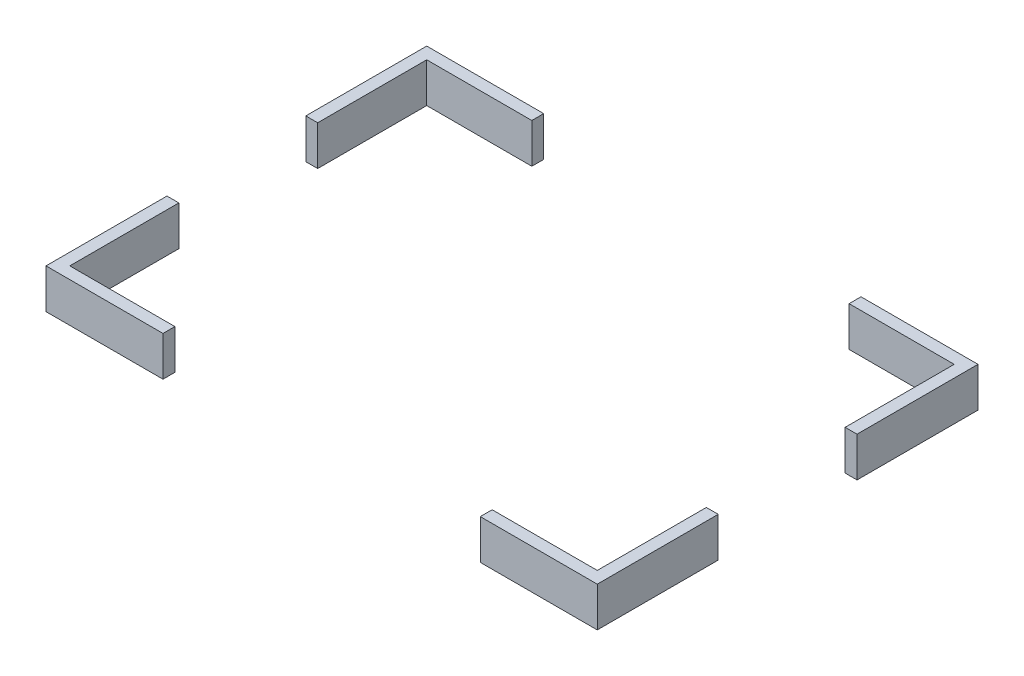
ISO-10303-21;
HEADER;
FILE_DESCRIPTION(('STEP AP214'),'2;1');
FILE_NAME('part.step','',(''),(''),'','','');
FILE_SCHEMA(('AUTOMOTIVE_DESIGN { 1 0 10303 214 1 1 1 1 }'));
ENDSEC;
DATA;
#1=APPLICATION_CONTEXT('core data for automotive mechanical design processes');
#2=APPLICATION_PROTOCOL_DEFINITION('international standard','automotive_design',2000,#1);
#3=PRODUCT_CONTEXT('',#1,'mechanical');
#4=PRODUCT('Part','Part','',(#3));
#5=PRODUCT_RELATED_PRODUCT_CATEGORY('part','',(#4));
#6=PRODUCT_DEFINITION_FORMATION('','',#4);
#7=PRODUCT_DEFINITION_CONTEXT('part definition',#1,'design');
#8=PRODUCT_DEFINITION('design','',#6,#7);
#9=PRODUCT_DEFINITION_SHAPE('','',#8);
#10=(LENGTH_UNIT() NAMED_UNIT(*) SI_UNIT(.MILLI.,.METRE.));
#11=(NAMED_UNIT(*) PLANE_ANGLE_UNIT() SI_UNIT($,.RADIAN.));
#12=(NAMED_UNIT(*) SI_UNIT($,.STERADIAN.) SOLID_ANGLE_UNIT());
#13=UNCERTAINTY_MEASURE_WITH_UNIT(LENGTH_MEASURE(1.E-05),#10,'distance_accuracy_value','');
#14=(GEOMETRIC_REPRESENTATION_CONTEXT(3) GLOBAL_UNCERTAINTY_ASSIGNED_CONTEXT((#13)) GLOBAL_UNIT_ASSIGNED_CONTEXT((#10,
#11,#12)) REPRESENTATION_CONTEXT('',''));
#15=CARTESIAN_POINT('',(0.,0.,0.));
#16=DIRECTION('',(0.,0.,1.));
#17=DIRECTION('',(1.,0.,0.));
#18=AXIS2_PLACEMENT_3D('',#15,#16,#17);
#19=CARTESIAN_POINT('',(-69.5,10.,-48.));
#20=DIRECTION('',(0.,0.,1.));
#21=DIRECTION('',(1.,0.,0.));
#22=AXIS2_PLACEMENT_3D('',#19,#20,#21);
#23=PLANE('',#22);
#24=DIRECTION('',(-1.,0.,0.));
#25=VECTOR('',#24,1.);
#26=CARTESIAN_POINT('',(-69.5,10.,-48.));
#27=LINE('',#26,#25);
#28=CARTESIAN_POINT('',(-40.,10.,-48.));
#29=VERTEX_POINT('',#28);
#30=CARTESIAN_POINT('',(-69.5,10.,-48.));
#31=VERTEX_POINT('',#30);
#32=EDGE_CURVE('E136',#29,#31,#27,.T.);
#33=ORIENTED_EDGE('',*,*,#32,.F.);
#34=DIRECTION('',(0.,-1.,0.));
#35=VECTOR('',#34,1.);
#36=CARTESIAN_POINT('',(-40.,10.,-48.));
#37=LINE('',#36,#35);
#38=CARTESIAN_POINT('',(-40.,0.,-48.));
#39=VERTEX_POINT('',#38);
#40=EDGE_CURVE('E68',#29,#39,#37,.T.);
#41=ORIENTED_EDGE('',*,*,#40,.T.);
#42=DIRECTION('',(-1.,0.,0.));
#43=VECTOR('',#42,1.);
#44=CARTESIAN_POINT('',(-69.5,0.,-48.));
#45=LINE('',#44,#43);
#46=CARTESIAN_POINT('',(-69.5,0.,-48.));
#47=VERTEX_POINT('',#46);
#48=EDGE_CURVE('E117',#39,#47,#45,.T.);
#49=ORIENTED_EDGE('',*,*,#48,.T.);
#50=DIRECTION('',(0.,-1.,0.));
#51=VECTOR('',#50,1.);
#52=CARTESIAN_POINT('',(-69.5,10.,-48.));
#53=LINE('',#52,#51);
#54=EDGE_CURVE('E130',#31,#47,#53,.T.);
#55=ORIENTED_EDGE('',*,*,#54,.F.);
#56=EDGE_LOOP('',(#33,#41,#49,#55));
#57=FACE_BOUND('',#56,.T.);
#58=ADVANCED_FACE('F50',(#57),#23,.F.);
#59=CARTESIAN_POINT('',(-66.5,10.,-45.));
#60=DIRECTION('',(0.,0.,1.));
#61=DIRECTION('',(1.,0.,0.));
#62=AXIS2_PLACEMENT_3D('',#59,#60,#61);
#63=PLANE('',#62);
#64=DIRECTION('',(0.,-1.,0.));
#65=VECTOR('',#64,1.);
#66=CARTESIAN_POINT('',(-40.,10.,-45.));
#67=LINE('',#66,#65);
#68=CARTESIAN_POINT('',(-40.,10.,-45.));
#69=VERTEX_POINT('',#68);
#70=CARTESIAN_POINT('',(-40.,0.,-45.));
#71=VERTEX_POINT('',#70);
#72=EDGE_CURVE('E12',#69,#71,#67,.T.);
#73=ORIENTED_EDGE('',*,*,#72,.F.);
#74=DIRECTION('',(-1.,0.,0.));
#75=VECTOR('',#74,1.);
#76=CARTESIAN_POINT('',(-66.5,10.,-45.));
#77=LINE('',#76,#75);
#78=CARTESIAN_POINT('',(-66.5,10.,-45.));
#79=VERTEX_POINT('',#78);
#80=EDGE_CURVE('E108',#69,#79,#77,.T.);
#81=ORIENTED_EDGE('',*,*,#80,.T.);
#82=DIRECTION('',(0.,-1.,0.));
#83=VECTOR('',#82,1.);
#84=CARTESIAN_POINT('',(-66.5,10.,-45.));
#85=LINE('',#84,#83);
#86=CARTESIAN_POINT('',(-66.5,0.,-45.));
#87=VERTEX_POINT('',#86);
#88=EDGE_CURVE('E116',#79,#87,#85,.T.);
#89=ORIENTED_EDGE('',*,*,#88,.T.);
#90=DIRECTION('',(-1.,0.,0.));
#91=VECTOR('',#90,1.);
#92=CARTESIAN_POINT('',(-66.5,0.,-45.));
#93=LINE('',#92,#91);
#94=EDGE_CURVE('E110',#71,#87,#93,.T.);
#95=ORIENTED_EDGE('',*,*,#94,.F.);
#96=EDGE_LOOP('',(#73,#81,#89,#95));
#97=FACE_BOUND('',#96,.T.);
#98=ADVANCED_FACE('F106',(#97),#63,.T.);
#99=CARTESIAN_POINT('',(0.,0.,0.));
#100=DIRECTION('',(0.,1.,0.));
#101=DIRECTION('',(0.,0.,1.));
#102=AXIS2_PLACEMENT_3D('',#99,#100,#101);
#103=PLANE('',#102);
#104=ORIENTED_EDGE('',*,*,#48,.F.);
#105=DIRECTION('',(0.,0.,1.));
#106=VECTOR('',#105,1.);
#107=CARTESIAN_POINT('',(-40.,0.,0.));
#108=LINE('',#107,#106);
#109=EDGE_CURVE('E119',#39,#71,#108,.T.);
#110=ORIENTED_EDGE('',*,*,#109,.T.);
#111=ORIENTED_EDGE('',*,*,#94,.T.);
#112=DIRECTION('',(0.,0.,1.));
#113=VECTOR('',#112,1.);
#114=CARTESIAN_POINT('',(-66.5,0.,-45.));
#115=LINE('',#114,#113);
#116=CARTESIAN_POINT('',(-66.5,0.,-17.5));
#117=VERTEX_POINT('',#116);
#118=EDGE_CURVE('E124',#87,#117,#115,.T.);
#119=ORIENTED_EDGE('',*,*,#118,.T.);
#120=DIRECTION('',(-1.,0.,0.));
#121=VECTOR('',#120,1.);
#122=CARTESIAN_POINT('',(0.,0.,-17.5));
#123=LINE('',#122,#121);
#124=CARTESIAN_POINT('',(-69.5,0.,-17.5));
#125=VERTEX_POINT('',#124);
#126=EDGE_CURVE('E53',#117,#125,#123,.T.);
#127=ORIENTED_EDGE('',*,*,#126,.T.);
#128=DIRECTION('',(0.,0.,1.));
#129=VECTOR('',#128,1.);
#130=CARTESIAN_POINT('',(-69.5,0.,-48.));
#131=LINE('',#130,#129);
#132=EDGE_CURVE('E140',#47,#125,#131,.T.);
#133=ORIENTED_EDGE('',*,*,#132,.F.);
#134=EDGE_LOOP('',(#104,#110,#111,#119,#127,#133));
#135=FACE_BOUND('',#134,.T.);
#136=ADVANCED_FACE('F172',(#135),#103,.F.);
#137=CARTESIAN_POINT('',(0.,10.,0.));
#138=DIRECTION('',(0.,1.,0.));
#139=DIRECTION('',(0.,0.,1.));
#140=AXIS2_PLACEMENT_3D('',#137,#138,#139);
#141=PLANE('',#140);
#142=DIRECTION('',(0.,0.,1.));
#143=VECTOR('',#142,1.);
#144=CARTESIAN_POINT('',(-40.,10.,0.));
#145=LINE('',#144,#143);
#146=EDGE_CURVE('E59',#29,#69,#145,.T.);
#147=ORIENTED_EDGE('',*,*,#146,.F.);
#148=ORIENTED_EDGE('',*,*,#32,.T.);
#149=DIRECTION('',(0.,0.,1.));
#150=VECTOR('',#149,1.);
#151=CARTESIAN_POINT('',(-69.5,10.,-48.));
#152=LINE('',#151,#150);
#153=CARTESIAN_POINT('',(-69.5,10.,-17.5));
#154=VERTEX_POINT('',#153);
#155=EDGE_CURVE('E137',#31,#154,#152,.T.);
#156=ORIENTED_EDGE('',*,*,#155,.T.);
#157=DIRECTION('',(-1.,0.,0.));
#158=VECTOR('',#157,1.);
#159=CARTESIAN_POINT('',(0.,10.,-17.5));
#160=LINE('',#159,#158);
#161=CARTESIAN_POINT('',(-66.5,10.,-17.5));
#162=VERTEX_POINT('',#161);
#163=EDGE_CURVE('E102',#162,#154,#160,.T.);
#164=ORIENTED_EDGE('',*,*,#163,.F.);
#165=DIRECTION('',(0.,0.,1.));
#166=VECTOR('',#165,1.);
#167=CARTESIAN_POINT('',(-66.5,10.,-45.));
#168=LINE('',#167,#166);
#169=EDGE_CURVE('E115',#79,#162,#168,.T.);
#170=ORIENTED_EDGE('',*,*,#169,.F.);
#171=ORIENTED_EDGE('',*,*,#80,.F.);
#172=EDGE_LOOP('',(#147,#148,#156,#164,#170,#171));
#173=FACE_BOUND('',#172,.T.);
#174=ADVANCED_FACE('F112',(#173),#141,.T.);
#175=CARTESIAN_POINT('',(-69.5,10.,-48.));
#176=DIRECTION('',(1.,0.,0.));
#177=DIRECTION('',(0.,0.,-1.));
#178=AXIS2_PLACEMENT_3D('',#175,#176,#177);
#179=PLANE('',#178);
#180=ORIENTED_EDGE('',*,*,#132,.T.);
#181=DIRECTION('',(0.,1.,0.));
#182=VECTOR('',#181,1.);
#183=CARTESIAN_POINT('',(-69.5,9.99999999999999,-17.5));
#184=LINE('',#183,#182);
#185=EDGE_CURVE('E134',#125,#154,#184,.T.);
#186=ORIENTED_EDGE('',*,*,#185,.T.);
#187=ORIENTED_EDGE('',*,*,#155,.F.);
#188=ORIENTED_EDGE('',*,*,#54,.T.);
#189=EDGE_LOOP('',(#180,#186,#187,#188));
#190=FACE_BOUND('',#189,.T.);
#191=ADVANCED_FACE('F154',(#190),#179,.F.);
#192=CARTESIAN_POINT('',(-66.5,10.,-45.));
#193=DIRECTION('',(1.,0.,0.));
#194=DIRECTION('',(0.,0.,-1.));
#195=AXIS2_PLACEMENT_3D('',#192,#193,#194);
#196=PLANE('',#195);
#197=DIRECTION('',(0.,1.,0.));
#198=VECTOR('',#197,1.);
#199=CARTESIAN_POINT('',(-66.5,9.99999999999999,-17.5));
#200=LINE('',#199,#198);
#201=EDGE_CURVE('E125',#117,#162,#200,.T.);
#202=ORIENTED_EDGE('',*,*,#201,.F.);
#203=ORIENTED_EDGE('',*,*,#118,.F.);
#204=ORIENTED_EDGE('',*,*,#88,.F.);
#205=ORIENTED_EDGE('',*,*,#169,.T.);
#206=EDGE_LOOP('',(#202,#203,#204,#205));
#207=FACE_BOUND('',#206,.T.);
#208=ADVANCED_FACE('F156',(#207),#196,.T.);
#209=CARTESIAN_POINT('',(-530.5,15.,-17.5));
#210=DIRECTION('',(0.,0.,-1.));
#211=DIRECTION('',(0.,1.,0.));
#212=AXIS2_PLACEMENT_3D('',#209,#210,#211);
#213=PLANE('',#212);
#214=ORIENTED_EDGE('',*,*,#126,.F.);
#215=ORIENTED_EDGE('',*,*,#201,.T.);
#216=ORIENTED_EDGE('',*,*,#163,.T.);
#217=ORIENTED_EDGE('',*,*,#185,.F.);
#218=EDGE_LOOP('',(#214,#215,#216,#217));
#219=FACE_BOUND('',#218,.T.);
#220=ADVANCED_FACE('F158',(#219),#213,.F.);
#221=CARTESIAN_POINT('',(-40.,-40.,-58.8496360731405));
#222=DIRECTION('',(-1.,0.,0.));
#223=DIRECTION('',(0.,0.,1.));
#224=AXIS2_PLACEMENT_3D('',#221,#222,#223);
#225=PLANE('',#224);
#226=ORIENTED_EDGE('',*,*,#146,.T.);
#227=ORIENTED_EDGE('',*,*,#72,.T.);
#228=ORIENTED_EDGE('',*,*,#109,.F.);
#229=ORIENTED_EDGE('',*,*,#40,.F.);
#230=EDGE_LOOP('',(#226,#227,#228,#229));
#231=FACE_BOUND('',#230,.T.);
#232=ADVANCED_FACE('F98',(#231),#225,.F.);
#233=CLOSED_SHELL('',(#58,#98,#136,#174,#191,#208,#220,#232));
#234=MANIFOLD_SOLID_BREP('B2',#233);
#235=CARTESIAN_POINT('',(0.,10.,0.));
#236=DIRECTION('',(0.,1.,0.));
#237=DIRECTION('',(0.,0.,1.));
#238=AXIS2_PLACEMENT_3D('',#235,#236,#237);
#239=PLANE('',#238);
#240=DIRECTION('',(0.,0.,1.));
#241=VECTOR('',#240,1.);
#242=CARTESIAN_POINT('',(-40.,10.,-58.8496360731405));
#243=LINE('',#242,#241);
#244=CARTESIAN_POINT('',(-40.,10.,45.));
#245=VERTEX_POINT('',#244);
#246=CARTESIAN_POINT('',(-40.,10.,48.));
#247=VERTEX_POINT('',#246);
#248=EDGE_CURVE('E48',#245,#247,#243,.T.);
#249=ORIENTED_EDGE('',*,*,#248,.F.);
#250=DIRECTION('',(1.,0.,0.));
#251=VECTOR('',#250,1.);
#252=CARTESIAN_POINT('',(-66.5,10.,45.));
#253=LINE('',#252,#251);
#254=CARTESIAN_POINT('',(-66.5,10.,45.));
#255=VERTEX_POINT('',#254);
#256=EDGE_CURVE('E296',#255,#245,#253,.T.);
#257=ORIENTED_EDGE('',*,*,#256,.F.);
#258=DIRECTION('',(0.,0.,1.));
#259=VECTOR('',#258,1.);
#260=CARTESIAN_POINT('',(-66.5,10.,-45.));
#261=LINE('',#260,#259);
#262=CARTESIAN_POINT('',(-66.5,10.,17.5));
#263=VERTEX_POINT('',#262);
#264=EDGE_CURVE('E330',#263,#255,#261,.T.);
#265=ORIENTED_EDGE('',*,*,#264,.F.);
#266=DIRECTION('',(1.,0.,0.));
#267=VECTOR('',#266,1.);
#268=CARTESIAN_POINT('',(0.,10.,17.5));
#269=LINE('',#268,#267);
#270=CARTESIAN_POINT('',(-69.5,10.,17.5));
#271=VERTEX_POINT('',#270);
#272=EDGE_CURVE('E312',#271,#263,#269,.T.);
#273=ORIENTED_EDGE('',*,*,#272,.F.);
#274=DIRECTION('',(0.,0.,1.));
#275=VECTOR('',#274,1.);
#276=CARTESIAN_POINT('',(-69.5,10.,-48.));
#277=LINE('',#276,#275);
#278=CARTESIAN_POINT('',(-69.5,10.,48.));
#279=VERTEX_POINT('',#278);
#280=EDGE_CURVE('E322',#271,#279,#277,.T.);
#281=ORIENTED_EDGE('',*,*,#280,.T.);
#282=DIRECTION('',(1.,0.,0.));
#283=VECTOR('',#282,1.);
#284=CARTESIAN_POINT('',(-69.5,10.,48.));
#285=LINE('',#284,#283);
#286=EDGE_CURVE('E239',#279,#247,#285,.T.);
#287=ORIENTED_EDGE('',*,*,#286,.T.);
#288=EDGE_LOOP('',(#249,#257,#265,#273,#281,#287));
#289=FACE_BOUND('',#288,.T.);
#290=ADVANCED_FACE('F236',(#289),#239,.T.);
#291=CARTESIAN_POINT('',(0.,0.,0.));
#292=DIRECTION('',(0.,1.,0.));
#293=DIRECTION('',(0.,0.,1.));
#294=AXIS2_PLACEMENT_3D('',#291,#292,#293);
#295=PLANE('',#294);
#296=DIRECTION('',(1.,0.,0.));
#297=VECTOR('',#296,1.);
#298=CARTESIAN_POINT('',(-66.5,0.,45.));
#299=LINE('',#298,#297);
#300=CARTESIAN_POINT('',(-66.5,0.,45.));
#301=VERTEX_POINT('',#300);
#302=CARTESIAN_POINT('',(-40.,0.,45.));
#303=VERTEX_POINT('',#302);
#304=EDGE_CURVE('E319',#301,#303,#299,.T.);
#305=ORIENTED_EDGE('',*,*,#304,.T.);
#306=DIRECTION('',(0.,0.,1.));
#307=VECTOR('',#306,1.);
#308=CARTESIAN_POINT('',(-40.,0.,0.));
#309=LINE('',#308,#307);
#310=CARTESIAN_POINT('',(-40.,0.,48.));
#311=VERTEX_POINT('',#310);
#312=EDGE_CURVE('E282',#303,#311,#309,.T.);
#313=ORIENTED_EDGE('',*,*,#312,.T.);
#314=DIRECTION('',(1.,0.,0.));
#315=VECTOR('',#314,1.);
#316=CARTESIAN_POINT('',(-69.5,0.,48.));
#317=LINE('',#316,#315);
#318=CARTESIAN_POINT('',(-69.5,0.,48.));
#319=VERTEX_POINT('',#318);
#320=EDGE_CURVE('E313',#319,#311,#317,.T.);
#321=ORIENTED_EDGE('',*,*,#320,.F.);
#322=DIRECTION('',(0.,0.,1.));
#323=VECTOR('',#322,1.);
#324=CARTESIAN_POINT('',(-69.5,0.,-48.));
#325=LINE('',#324,#323);
#326=CARTESIAN_POINT('',(-69.5,0.,17.5));
#327=VERTEX_POINT('',#326);
#328=EDGE_CURVE('E306',#327,#319,#325,.T.);
#329=ORIENTED_EDGE('',*,*,#328,.F.);
#330=DIRECTION('',(1.,0.,0.));
#331=VECTOR('',#330,1.);
#332=CARTESIAN_POINT('',(0.,0.,17.5));
#333=LINE('',#332,#331);
#334=CARTESIAN_POINT('',(-66.5,0.,17.5));
#335=VERTEX_POINT('',#334);
#336=EDGE_CURVE('E317',#327,#335,#333,.T.);
#337=ORIENTED_EDGE('',*,*,#336,.T.);
#338=DIRECTION('',(0.,0.,1.));
#339=VECTOR('',#338,1.);
#340=CARTESIAN_POINT('',(-66.5,0.,-45.));
#341=LINE('',#340,#339);
#342=EDGE_CURVE('E316',#335,#301,#341,.T.);
#343=ORIENTED_EDGE('',*,*,#342,.T.);
#344=EDGE_LOOP('',(#305,#313,#321,#329,#337,#343));
#345=FACE_BOUND('',#344,.T.);
#346=ADVANCED_FACE('F337',(#345),#295,.F.);
#347=CARTESIAN_POINT('',(-69.5,10.,48.));
#348=DIRECTION('',(0.,0.,-1.));
#349=DIRECTION('',(-1.,0.,0.));
#350=AXIS2_PLACEMENT_3D('',#347,#348,#349);
#351=PLANE('',#350);
#352=ORIENTED_EDGE('',*,*,#320,.T.);
#353=DIRECTION('',(0.,1.,0.));
#354=VECTOR('',#353,1.);
#355=CARTESIAN_POINT('',(-40.,10.,48.));
#356=LINE('',#355,#354);
#357=EDGE_CURVE('E253',#311,#247,#356,.T.);
#358=ORIENTED_EDGE('',*,*,#357,.T.);
#359=ORIENTED_EDGE('',*,*,#286,.F.);
#360=DIRECTION('',(0.,-1.,0.));
#361=VECTOR('',#360,1.);
#362=CARTESIAN_POINT('',(-69.5,10.,48.));
#363=LINE('',#362,#361);
#364=EDGE_CURVE('E303',#279,#319,#363,.T.);
#365=ORIENTED_EDGE('',*,*,#364,.T.);
#366=EDGE_LOOP('',(#352,#358,#359,#365));
#367=FACE_BOUND('',#366,.T.);
#368=ADVANCED_FACE('F333',(#367),#351,.F.);
#369=CARTESIAN_POINT('',(-66.5,10.,45.));
#370=DIRECTION('',(0.,0.,-1.));
#371=DIRECTION('',(-1.,0.,0.));
#372=AXIS2_PLACEMENT_3D('',#369,#370,#371);
#373=PLANE('',#372);
#374=DIRECTION('',(0.,1.,0.));
#375=VECTOR('',#374,1.);
#376=CARTESIAN_POINT('',(-40.,10.,45.));
#377=LINE('',#376,#375);
#378=EDGE_CURVE('E245',#303,#245,#377,.T.);
#379=ORIENTED_EDGE('',*,*,#378,.F.);
#380=ORIENTED_EDGE('',*,*,#304,.F.);
#381=DIRECTION('',(0.,-1.,0.));
#382=VECTOR('',#381,1.);
#383=CARTESIAN_POINT('',(-66.5,10.,45.));
#384=LINE('',#383,#382);
#385=EDGE_CURVE('E301',#255,#301,#384,.T.);
#386=ORIENTED_EDGE('',*,*,#385,.F.);
#387=ORIENTED_EDGE('',*,*,#256,.T.);
#388=EDGE_LOOP('',(#379,#380,#386,#387));
#389=FACE_BOUND('',#388,.T.);
#390=ADVANCED_FACE('F299',(#389),#373,.T.);
#391=CARTESIAN_POINT('',(-69.5,10.,-48.));
#392=DIRECTION('',(1.,0.,0.));
#393=DIRECTION('',(0.,0.,-1.));
#394=AXIS2_PLACEMENT_3D('',#391,#392,#393);
#395=PLANE('',#394);
#396=ORIENTED_EDGE('',*,*,#280,.F.);
#397=DIRECTION('',(0.,-1.,0.));
#398=VECTOR('',#397,1.);
#399=CARTESIAN_POINT('',(-69.5,9.99999999999998,17.5));
#400=LINE('',#399,#398);
#401=EDGE_CURVE('E302',#271,#327,#400,.T.);
#402=ORIENTED_EDGE('',*,*,#401,.T.);
#403=ORIENTED_EDGE('',*,*,#328,.T.);
#404=ORIENTED_EDGE('',*,*,#364,.F.);
#405=EDGE_LOOP('',(#396,#402,#403,#404));
#406=FACE_BOUND('',#405,.T.);
#407=ADVANCED_FACE('F346',(#406),#395,.F.);
#408=CARTESIAN_POINT('',(-66.5,10.,-45.));
#409=DIRECTION('',(1.,0.,0.));
#410=DIRECTION('',(0.,0.,-1.));
#411=AXIS2_PLACEMENT_3D('',#408,#409,#410);
#412=PLANE('',#411);
#413=DIRECTION('',(0.,-1.,0.));
#414=VECTOR('',#413,1.);
#415=CARTESIAN_POINT('',(-66.5,9.99999999999999,17.5));
#416=LINE('',#415,#414);
#417=EDGE_CURVE('E290',#263,#335,#416,.T.);
#418=ORIENTED_EDGE('',*,*,#417,.F.);
#419=ORIENTED_EDGE('',*,*,#264,.T.);
#420=ORIENTED_EDGE('',*,*,#385,.T.);
#421=ORIENTED_EDGE('',*,*,#342,.F.);
#422=EDGE_LOOP('',(#418,#419,#420,#421));
#423=FACE_BOUND('',#422,.T.);
#424=ADVANCED_FACE('F343',(#423),#412,.T.);
#425=CARTESIAN_POINT('',(-530.5,15.,17.5));
#426=DIRECTION('',(0.,0.,1.));
#427=DIRECTION('',(0.,-1.,0.));
#428=AXIS2_PLACEMENT_3D('',#425,#426,#427);
#429=PLANE('',#428);
#430=ORIENTED_EDGE('',*,*,#272,.T.);
#431=ORIENTED_EDGE('',*,*,#417,.T.);
#432=ORIENTED_EDGE('',*,*,#336,.F.);
#433=ORIENTED_EDGE('',*,*,#401,.F.);
#434=EDGE_LOOP('',(#430,#431,#432,#433));
#435=FACE_BOUND('',#434,.T.);
#436=ADVANCED_FACE('F345',(#435),#429,.F.);
#437=CARTESIAN_POINT('',(-40.,-40.,-58.8496360731405));
#438=DIRECTION('',(-1.,0.,0.));
#439=DIRECTION('',(0.,0.,1.));
#440=AXIS2_PLACEMENT_3D('',#437,#438,#439);
#441=PLANE('',#440);
#442=ORIENTED_EDGE('',*,*,#312,.F.);
#443=ORIENTED_EDGE('',*,*,#378,.T.);
#444=ORIENTED_EDGE('',*,*,#248,.T.);
#445=ORIENTED_EDGE('',*,*,#357,.F.);
#446=EDGE_LOOP('',(#442,#443,#444,#445));
#447=FACE_BOUND('',#446,.T.);
#448=ADVANCED_FACE('F285',(#447),#441,.F.);
#449=CLOSED_SHELL('',(#290,#346,#368,#390,#407,#424,#436,#448));
#450=MANIFOLD_SOLID_BREP('B6',#449);
#451=CARTESIAN_POINT('',(-530.5,15.,17.5));
#452=DIRECTION('',(0.,0.,1.));
#453=DIRECTION('',(0.,-1.,0.));
#454=AXIS2_PLACEMENT_3D('',#451,#452,#453);
#455=PLANE('',#454);
#456=DIRECTION('',(1.,0.,0.));
#457=VECTOR('',#456,1.);
#458=CARTESIAN_POINT('',(0.,10.,17.5));
#459=LINE('',#458,#457);
#460=CARTESIAN_POINT('',(66.5,10.,17.5));
#461=VERTEX_POINT('',#460);
#462=CARTESIAN_POINT('',(69.5,10.,17.5));
#463=VERTEX_POINT('',#462);
#464=EDGE_CURVE('E454',#461,#463,#459,.T.);
#465=ORIENTED_EDGE('',*,*,#464,.T.);
#466=DIRECTION('',(0.,-1.,0.));
#467=VECTOR('',#466,1.);
#468=CARTESIAN_POINT('',(69.5,15.,17.5));
#469=LINE('',#468,#467);
#470=CARTESIAN_POINT('',(69.5,0.,17.5));
#471=VERTEX_POINT('',#470);
#472=EDGE_CURVE('E510',#463,#471,#469,.T.);
#473=ORIENTED_EDGE('',*,*,#472,.T.);
#474=DIRECTION('',(1.,0.,0.));
#475=VECTOR('',#474,1.);
#476=CARTESIAN_POINT('',(0.,0.,17.5));
#477=LINE('',#476,#475);
#478=CARTESIAN_POINT('',(66.5,0.,17.5));
#479=VERTEX_POINT('',#478);
#480=EDGE_CURVE('E511',#479,#471,#477,.T.);
#481=ORIENTED_EDGE('',*,*,#480,.F.);
#482=DIRECTION('',(0.,1.,0.));
#483=VECTOR('',#482,1.);
#484=CARTESIAN_POINT('',(66.5,9.99999999999999,17.5));
#485=LINE('',#484,#483);
#486=EDGE_CURVE('E429',#479,#461,#485,.T.);
#487=ORIENTED_EDGE('',*,*,#486,.T.);
#488=EDGE_LOOP('',(#465,#473,#481,#487));
#489=FACE_BOUND('',#488,.T.);
#490=ADVANCED_FACE('F421',(#489),#455,.F.);
#491=CARTESIAN_POINT('',(69.5,10.,-48.));
#492=DIRECTION('',(-1.,0.,0.));
#493=DIRECTION('',(0.,0.,1.));
#494=AXIS2_PLACEMENT_3D('',#491,#492,#493);
#495=PLANE('',#494);
#496=DIRECTION('',(0.,0.,-1.));
#497=VECTOR('',#496,1.);
#498=CARTESIAN_POINT('',(69.5,0.,-48.));
#499=LINE('',#498,#497);
#500=CARTESIAN_POINT('',(69.5,0.,48.));
#501=VERTEX_POINT('',#500);
#502=EDGE_CURVE('E514',#501,#471,#499,.T.);
#503=ORIENTED_EDGE('',*,*,#502,.T.);
#504=ORIENTED_EDGE('',*,*,#472,.F.);
#505=DIRECTION('',(0.,0.,-1.));
#506=VECTOR('',#505,1.);
#507=CARTESIAN_POINT('',(69.5,10.,-48.));
#508=LINE('',#507,#506);
#509=CARTESIAN_POINT('',(69.5,10.,48.));
#510=VERTEX_POINT('',#509);
#511=EDGE_CURVE('E497',#510,#463,#508,.T.);
#512=ORIENTED_EDGE('',*,*,#511,.F.);
#513=DIRECTION('',(0.,-1.,0.));
#514=VECTOR('',#513,1.);
#515=CARTESIAN_POINT('',(69.5,10.,48.));
#516=LINE('',#515,#514);
#517=EDGE_CURVE('E495',#510,#501,#516,.T.);
#518=ORIENTED_EDGE('',*,*,#517,.T.);
#519=EDGE_LOOP('',(#503,#504,#512,#518));
#520=FACE_BOUND('',#519,.T.);
#521=ADVANCED_FACE('F529',(#520),#495,.F.);
#522=CARTESIAN_POINT('',(66.5,10.,-45.));
#523=DIRECTION('',(-1.,0.,0.));
#524=DIRECTION('',(0.,0.,1.));
#525=AXIS2_PLACEMENT_3D('',#522,#523,#524);
#526=PLANE('',#525);
#527=ORIENTED_EDGE('',*,*,#486,.F.);
#528=DIRECTION('',(0.,0.,-1.));
#529=VECTOR('',#528,1.);
#530=CARTESIAN_POINT('',(66.5,0.,-45.));
#531=LINE('',#530,#529);
#532=CARTESIAN_POINT('',(66.5,0.,45.));
#533=VERTEX_POINT('',#532);
#534=EDGE_CURVE('E507',#533,#479,#531,.T.);
#535=ORIENTED_EDGE('',*,*,#534,.F.);
#536=DIRECTION('',(0.,-1.,0.));
#537=VECTOR('',#536,1.);
#538=CARTESIAN_POINT('',(66.5,10.,45.));
#539=LINE('',#538,#537);
#540=CARTESIAN_POINT('',(66.5,10.,45.));
#541=VERTEX_POINT('',#540);
#542=EDGE_CURVE('E504',#541,#533,#539,.T.);
#543=ORIENTED_EDGE('',*,*,#542,.F.);
#544=DIRECTION('',(0.,0.,-1.));
#545=VECTOR('',#544,1.);
#546=CARTESIAN_POINT('',(66.5,10.,-45.));
#547=LINE('',#546,#545);
#548=EDGE_CURVE('E518',#541,#461,#547,.T.);
#549=ORIENTED_EDGE('',*,*,#548,.T.);
#550=EDGE_LOOP('',(#527,#535,#543,#549));
#551=FACE_BOUND('',#550,.T.);
#552=ADVANCED_FACE('F525',(#551),#526,.T.);
#553=CARTESIAN_POINT('',(-66.5,10.,45.));
#554=DIRECTION('',(0.,0.,-1.));
#555=DIRECTION('',(-1.,0.,0.));
#556=AXIS2_PLACEMENT_3D('',#553,#554,#555);
#557=PLANE('',#556);
#558=DIRECTION('',(0.,-1.,0.));
#559=VECTOR('',#558,1.);
#560=CARTESIAN_POINT('',(40.,10.,45.));
#561=LINE('',#560,#559);
#562=CARTESIAN_POINT('',(40.,10.,45.));
#563=VERTEX_POINT('',#562);
#564=CARTESIAN_POINT('',(40.,0.,45.));
#565=VERTEX_POINT('',#564);
#566=EDGE_CURVE('E234',#563,#565,#561,.T.);
#567=ORIENTED_EDGE('',*,*,#566,.F.);
#568=DIRECTION('',(1.,0.,0.));
#569=VECTOR('',#568,1.);
#570=CARTESIAN_POINT('',(-66.5,10.,45.));
#571=LINE('',#570,#569);
#572=EDGE_CURVE('E491',#563,#541,#571,.T.);
#573=ORIENTED_EDGE('',*,*,#572,.T.);
#574=ORIENTED_EDGE('',*,*,#542,.T.);
#575=DIRECTION('',(1.,0.,0.));
#576=VECTOR('',#575,1.);
#577=CARTESIAN_POINT('',(-66.5,0.,45.));
#578=LINE('',#577,#576);
#579=EDGE_CURVE('E461',#565,#533,#578,.T.);
#580=ORIENTED_EDGE('',*,*,#579,.F.);
#581=EDGE_LOOP('',(#567,#573,#574,#580));
#582=FACE_BOUND('',#581,.T.);
#583=ADVANCED_FACE('F531',(#582),#557,.T.);
#584=CARTESIAN_POINT('',(-69.5,10.,48.));
#585=DIRECTION('',(0.,0.,-1.));
#586=DIRECTION('',(-1.,0.,0.));
#587=AXIS2_PLACEMENT_3D('',#584,#585,#586);
#588=PLANE('',#587);
#589=DIRECTION('',(1.,0.,0.));
#590=VECTOR('',#589,1.);
#591=CARTESIAN_POINT('',(-69.5,10.,48.));
#592=LINE('',#591,#590);
#593=CARTESIAN_POINT('',(40.,10.,48.));
#594=VERTEX_POINT('',#593);
#595=EDGE_CURVE('E484',#594,#510,#592,.T.);
#596=ORIENTED_EDGE('',*,*,#595,.F.);
#597=DIRECTION('',(0.,-1.,0.));
#598=VECTOR('',#597,1.);
#599=CARTESIAN_POINT('',(40.,10.,48.));
#600=LINE('',#599,#598);
#601=CARTESIAN_POINT('',(40.,0.,48.));
#602=VERTEX_POINT('',#601);
#603=EDGE_CURVE('E478',#594,#602,#600,.T.);
#604=ORIENTED_EDGE('',*,*,#603,.T.);
#605=DIRECTION('',(1.,0.,0.));
#606=VECTOR('',#605,1.);
#607=CARTESIAN_POINT('',(-69.5,0.,48.));
#608=LINE('',#607,#606);
#609=EDGE_CURVE('E502',#602,#501,#608,.T.);
#610=ORIENTED_EDGE('',*,*,#609,.T.);
#611=ORIENTED_EDGE('',*,*,#517,.F.);
#612=EDGE_LOOP('',(#596,#604,#610,#611));
#613=FACE_BOUND('',#612,.T.);
#614=ADVANCED_FACE('F493',(#613),#588,.F.);
#615=CARTESIAN_POINT('',(0.,0.,0.));
#616=DIRECTION('',(0.,1.,0.));
#617=DIRECTION('',(0.,0.,1.));
#618=AXIS2_PLACEMENT_3D('',#615,#616,#617);
#619=PLANE('',#618);
#620=ORIENTED_EDGE('',*,*,#609,.F.);
#621=DIRECTION('',(0.,0.,-1.));
#622=VECTOR('',#621,1.);
#623=CARTESIAN_POINT('',(40.,0.,0.));
#624=LINE('',#623,#622);
#625=EDGE_CURVE('E480',#602,#565,#624,.T.);
#626=ORIENTED_EDGE('',*,*,#625,.T.);
#627=ORIENTED_EDGE('',*,*,#579,.T.);
#628=ORIENTED_EDGE('',*,*,#534,.T.);
#629=ORIENTED_EDGE('',*,*,#480,.T.);
#630=ORIENTED_EDGE('',*,*,#502,.F.);
#631=EDGE_LOOP('',(#620,#626,#627,#628,#629,#630));
#632=FACE_BOUND('',#631,.T.);
#633=ADVANCED_FACE('F521',(#632),#619,.F.);
#634=CARTESIAN_POINT('',(0.,10.,0.));
#635=DIRECTION('',(0.,1.,0.));
#636=DIRECTION('',(0.,0.,1.));
#637=AXIS2_PLACEMENT_3D('',#634,#635,#636);
#638=PLANE('',#637);
#639=DIRECTION('',(0.,0.,-1.));
#640=VECTOR('',#639,1.);
#641=CARTESIAN_POINT('',(40.,10.,-58.8496360731405));
#642=LINE('',#641,#640);
#643=EDGE_CURVE('E435',#594,#563,#642,.T.);
#644=ORIENTED_EDGE('',*,*,#643,.F.);
#645=ORIENTED_EDGE('',*,*,#595,.T.);
#646=ORIENTED_EDGE('',*,*,#511,.T.);
#647=ORIENTED_EDGE('',*,*,#464,.F.);
#648=ORIENTED_EDGE('',*,*,#548,.F.);
#649=ORIENTED_EDGE('',*,*,#572,.F.);
#650=EDGE_LOOP('',(#644,#645,#646,#647,#648,#649));
#651=FACE_BOUND('',#650,.T.);
#652=ADVANCED_FACE('F423',(#651),#638,.T.);
#653=CARTESIAN_POINT('',(40.,-40.,-58.8496360731405));
#654=DIRECTION('',(1.,0.,0.));
#655=DIRECTION('',(0.,0.,-1.));
#656=AXIS2_PLACEMENT_3D('',#653,#654,#655);
#657=PLANE('',#656);
#658=ORIENTED_EDGE('',*,*,#643,.T.);
#659=ORIENTED_EDGE('',*,*,#566,.T.);
#660=ORIENTED_EDGE('',*,*,#625,.F.);
#661=ORIENTED_EDGE('',*,*,#603,.F.);
#662=EDGE_LOOP('',(#658,#659,#660,#661));
#663=FACE_BOUND('',#662,.T.);
#664=ADVANCED_FACE('F479',(#663),#657,.F.);
#665=CLOSED_SHELL('',(#490,#521,#552,#583,#614,#633,#652,#664));
#666=MANIFOLD_SOLID_BREP('B42',#665);
#667=CARTESIAN_POINT('',(69.5,10.,-48.));
#668=DIRECTION('',(-1.,0.,0.));
#669=DIRECTION('',(0.,0.,1.));
#670=AXIS2_PLACEMENT_3D('',#667,#668,#669);
#671=PLANE('',#670);
#672=DIRECTION('',(0.,0.,-1.));
#673=VECTOR('',#672,1.);
#674=CARTESIAN_POINT('',(69.5,10.,-48.));
#675=LINE('',#674,#673);
#676=CARTESIAN_POINT('',(69.5,10.,-17.5));
#677=VERTEX_POINT('',#676);
#678=CARTESIAN_POINT('',(69.5,10.,-48.));
#679=VERTEX_POINT('',#678);
#680=EDGE_CURVE('E667',#677,#679,#675,.T.);
#681=ORIENTED_EDGE('',*,*,#680,.F.);
#682=DIRECTION('',(0.,1.,0.));
#683=VECTOR('',#682,1.);
#684=CARTESIAN_POINT('',(69.5,15.,-17.5));
#685=LINE('',#684,#683);
#686=CARTESIAN_POINT('',(69.5,0.,-17.5));
#687=VERTEX_POINT('',#686);
#688=EDGE_CURVE('E663',#687,#677,#685,.T.);
#689=ORIENTED_EDGE('',*,*,#688,.F.);
#690=DIRECTION('',(0.,0.,-1.));
#691=VECTOR('',#690,1.);
#692=CARTESIAN_POINT('',(69.5,0.,-48.));
#693=LINE('',#692,#691);
#694=CARTESIAN_POINT('',(69.5,0.,-48.));
#695=VERTEX_POINT('',#694);
#696=EDGE_CURVE('E678',#687,#695,#693,.T.);
#697=ORIENTED_EDGE('',*,*,#696,.T.);
#698=DIRECTION('',(0.,-1.,0.));
#699=VECTOR('',#698,1.);
#700=CARTESIAN_POINT('',(69.5,10.,-48.));
#701=LINE('',#700,#699);
#702=EDGE_CURVE('E670',#679,#695,#701,.T.);
#703=ORIENTED_EDGE('',*,*,#702,.F.);
#704=EDGE_LOOP('',(#681,#689,#697,#703));
#705=FACE_BOUND('',#704,.T.);
#706=ADVANCED_FACE('F597',(#705),#671,.F.);
#707=CARTESIAN_POINT('',(-530.5,15.,-17.5));
#708=DIRECTION('',(0.,0.,-1.));
#709=DIRECTION('',(0.,1.,0.));
#710=AXIS2_PLACEMENT_3D('',#707,#708,#709);
#711=PLANE('',#710);
#712=DIRECTION('',(-1.,0.,0.));
#713=VECTOR('',#712,1.);
#714=CARTESIAN_POINT('',(0.,10.,-17.5));
#715=LINE('',#714,#713);
#716=CARTESIAN_POINT('',(66.5,10.,-17.5));
#717=VERTEX_POINT('',#716);
#718=EDGE_CURVE('E619',#677,#717,#715,.T.);
#719=ORIENTED_EDGE('',*,*,#718,.T.);
#720=DIRECTION('',(0.,-1.,0.));
#721=VECTOR('',#720,1.);
#722=CARTESIAN_POINT('',(66.5,9.99999999999999,-17.5));
#723=LINE('',#722,#721);
#724=CARTESIAN_POINT('',(66.5,0.,-17.5));
#725=VERTEX_POINT('',#724);
#726=EDGE_CURVE('E605',#717,#725,#723,.T.);
#727=ORIENTED_EDGE('',*,*,#726,.T.);
#728=DIRECTION('',(-1.,0.,0.));
#729=VECTOR('',#728,1.);
#730=CARTESIAN_POINT('',(0.,0.,-17.5));
#731=LINE('',#730,#729);
#732=EDGE_CURVE('E686',#687,#725,#731,.T.);
#733=ORIENTED_EDGE('',*,*,#732,.F.);
#734=ORIENTED_EDGE('',*,*,#688,.T.);
#735=EDGE_LOOP('',(#719,#727,#733,#734));
#736=FACE_BOUND('',#735,.T.);
#737=ADVANCED_FACE('F685',(#736),#711,.F.);
#738=CARTESIAN_POINT('',(66.5,10.,-45.));
#739=DIRECTION('',(-1.,0.,0.));
#740=DIRECTION('',(0.,0.,1.));
#741=AXIS2_PLACEMENT_3D('',#738,#739,#740);
#742=PLANE('',#741);
#743=ORIENTED_EDGE('',*,*,#726,.F.);
#744=DIRECTION('',(0.,0.,-1.));
#745=VECTOR('',#744,1.);
#746=CARTESIAN_POINT('',(66.5,10.,-45.));
#747=LINE('',#746,#745);
#748=CARTESIAN_POINT('',(66.5,10.,-45.));
#749=VERTEX_POINT('',#748);
#750=EDGE_CURVE('E707',#717,#749,#747,.T.);
#751=ORIENTED_EDGE('',*,*,#750,.T.);
#752=DIRECTION('',(0.,-1.,0.));
#753=VECTOR('',#752,1.);
#754=CARTESIAN_POINT('',(66.5,10.,-45.));
#755=LINE('',#754,#753);
#756=CARTESIAN_POINT('',(66.5,0.,-45.));
#757=VERTEX_POINT('',#756);
#758=EDGE_CURVE('E681',#749,#757,#755,.T.);
#759=ORIENTED_EDGE('',*,*,#758,.T.);
#760=DIRECTION('',(0.,0.,-1.));
#761=VECTOR('',#760,1.);
#762=CARTESIAN_POINT('',(66.5,0.,-45.));
#763=LINE('',#762,#761);
#764=EDGE_CURVE('E695',#725,#757,#763,.T.);
#765=ORIENTED_EDGE('',*,*,#764,.F.);
#766=EDGE_LOOP('',(#743,#751,#759,#765));
#767=FACE_BOUND('',#766,.T.);
#768=ADVANCED_FACE('F699',(#767),#742,.T.);
#769=CARTESIAN_POINT('',(0.,10.,0.));
#770=DIRECTION('',(0.,1.,0.));
#771=DIRECTION('',(0.,0.,1.));
#772=AXIS2_PLACEMENT_3D('',#769,#770,#771);
#773=PLANE('',#772);
#774=DIRECTION('',(0.,0.,-1.));
#775=VECTOR('',#774,1.);
#776=CARTESIAN_POINT('',(40.,10.,0.));
#777=LINE('',#776,#775);
#778=CARTESIAN_POINT('',(40.,10.,-45.));
#779=VERTEX_POINT('',#778);
#780=CARTESIAN_POINT('',(40.,10.,-48.));
#781=VERTEX_POINT('',#780);
#782=EDGE_CURVE('E419',#779,#781,#777,.T.);
#783=ORIENTED_EDGE('',*,*,#782,.F.);
#784=DIRECTION('',(-1.,0.,0.));
#785=VECTOR('',#784,1.);
#786=CARTESIAN_POINT('',(-66.5,10.,-45.));
#787=LINE('',#786,#785);
#788=EDGE_CURVE('E711',#749,#779,#787,.T.);
#789=ORIENTED_EDGE('',*,*,#788,.F.);
#790=ORIENTED_EDGE('',*,*,#750,.F.);
#791=ORIENTED_EDGE('',*,*,#718,.F.);
#792=ORIENTED_EDGE('',*,*,#680,.T.);
#793=DIRECTION('',(-1.,0.,0.));
#794=VECTOR('',#793,1.);
#795=CARTESIAN_POINT('',(-69.5,10.,-48.));
#796=LINE('',#795,#794);
#797=EDGE_CURVE('E659',#679,#781,#796,.T.);
#798=ORIENTED_EDGE('',*,*,#797,.T.);
#799=EDGE_LOOP('',(#783,#789,#790,#791,#792,#798));
#800=FACE_BOUND('',#799,.T.);
#801=ADVANCED_FACE('F665',(#800),#773,.T.);
#802=CARTESIAN_POINT('',(0.,0.,0.));
#803=DIRECTION('',(0.,1.,0.));
#804=DIRECTION('',(0.,0.,1.));
#805=AXIS2_PLACEMENT_3D('',#802,#803,#804);
#806=PLANE('',#805);
#807=DIRECTION('',(-1.,0.,0.));
#808=VECTOR('',#807,1.);
#809=CARTESIAN_POINT('',(-66.5,0.,-45.));
#810=LINE('',#809,#808);
#811=CARTESIAN_POINT('',(40.,0.,-45.));
#812=VERTEX_POINT('',#811);
#813=EDGE_CURVE('E703',#757,#812,#810,.T.);
#814=ORIENTED_EDGE('',*,*,#813,.T.);
#815=DIRECTION('',(0.,0.,-1.));
#816=VECTOR('',#815,1.);
#817=CARTESIAN_POINT('',(40.,0.,0.));
#818=LINE('',#817,#816);
#819=CARTESIAN_POINT('',(40.,0.,-48.));
#820=VERTEX_POINT('',#819);
#821=EDGE_CURVE('E722',#812,#820,#818,.T.);
#822=ORIENTED_EDGE('',*,*,#821,.T.);
#823=DIRECTION('',(-1.,0.,0.));
#824=VECTOR('',#823,1.);
#825=CARTESIAN_POINT('',(-69.5,0.,-48.));
#826=LINE('',#825,#824);
#827=EDGE_CURVE('E661',#695,#820,#826,.T.);
#828=ORIENTED_EDGE('',*,*,#827,.F.);
#829=ORIENTED_EDGE('',*,*,#696,.F.);
#830=ORIENTED_EDGE('',*,*,#732,.T.);
#831=ORIENTED_EDGE('',*,*,#764,.T.);
#832=EDGE_LOOP('',(#814,#822,#828,#829,#830,#831));
#833=FACE_BOUND('',#832,.T.);
#834=ADVANCED_FACE('F694',(#833),#806,.F.);
#835=CARTESIAN_POINT('',(-66.5,10.,-45.));
#836=DIRECTION('',(0.,0.,1.));
#837=DIRECTION('',(1.,0.,0.));
#838=AXIS2_PLACEMENT_3D('',#835,#836,#837);
#839=PLANE('',#838);
#840=DIRECTION('',(0.,1.,0.));
#841=VECTOR('',#840,1.);
#842=CARTESIAN_POINT('',(40.,10.,-45.));
#843=LINE('',#842,#841);
#844=EDGE_CURVE('E611',#812,#779,#843,.T.);
#845=ORIENTED_EDGE('',*,*,#844,.F.);
#846=ORIENTED_EDGE('',*,*,#813,.F.);
#847=ORIENTED_EDGE('',*,*,#758,.F.);
#848=ORIENTED_EDGE('',*,*,#788,.T.);
#849=EDGE_LOOP('',(#845,#846,#847,#848));
#850=FACE_BOUND('',#849,.T.);
#851=ADVANCED_FACE('F724',(#850),#839,.T.);
#852=CARTESIAN_POINT('',(-69.5,10.,-48.));
#853=DIRECTION('',(0.,0.,1.));
#854=DIRECTION('',(1.,0.,0.));
#855=AXIS2_PLACEMENT_3D('',#852,#853,#854);
#856=PLANE('',#855);
#857=ORIENTED_EDGE('',*,*,#827,.T.);
#858=DIRECTION('',(0.,1.,0.));
#859=VECTOR('',#858,1.);
#860=CARTESIAN_POINT('',(40.,10.,-48.));
#861=LINE('',#860,#859);
#862=EDGE_CURVE('E648',#820,#781,#861,.T.);
#863=ORIENTED_EDGE('',*,*,#862,.T.);
#864=ORIENTED_EDGE('',*,*,#797,.F.);
#865=ORIENTED_EDGE('',*,*,#702,.T.);
#866=EDGE_LOOP('',(#857,#863,#864,#865));
#867=FACE_BOUND('',#866,.T.);
#868=ADVANCED_FACE('F657',(#867),#856,.F.);
#869=CARTESIAN_POINT('',(40.,-40.,-58.8496360731405));
#870=DIRECTION('',(1.,0.,0.));
#871=DIRECTION('',(0.,0.,-1.));
#872=AXIS2_PLACEMENT_3D('',#869,#870,#871);
#873=PLANE('',#872);
#874=ORIENTED_EDGE('',*,*,#821,.F.);
#875=ORIENTED_EDGE('',*,*,#844,.T.);
#876=ORIENTED_EDGE('',*,*,#782,.T.);
#877=ORIENTED_EDGE('',*,*,#862,.F.);
#878=EDGE_LOOP('',(#874,#875,#876,#877));
#879=FACE_BOUND('',#878,.T.);
#880=ADVANCED_FACE('F647',(#879),#873,.F.);
#881=CLOSED_SHELL('',(#706,#737,#768,#801,#834,#851,#868,#880));
#882=MANIFOLD_SOLID_BREP('B228',#881);
#883=ADVANCED_BREP_SHAPE_REPRESENTATION('',(#18,#234,#450,#666,#882),#14);
#884=SHAPE_DEFINITION_REPRESENTATION(#9,#883);
ENDSEC;
END-ISO-10303-21;
